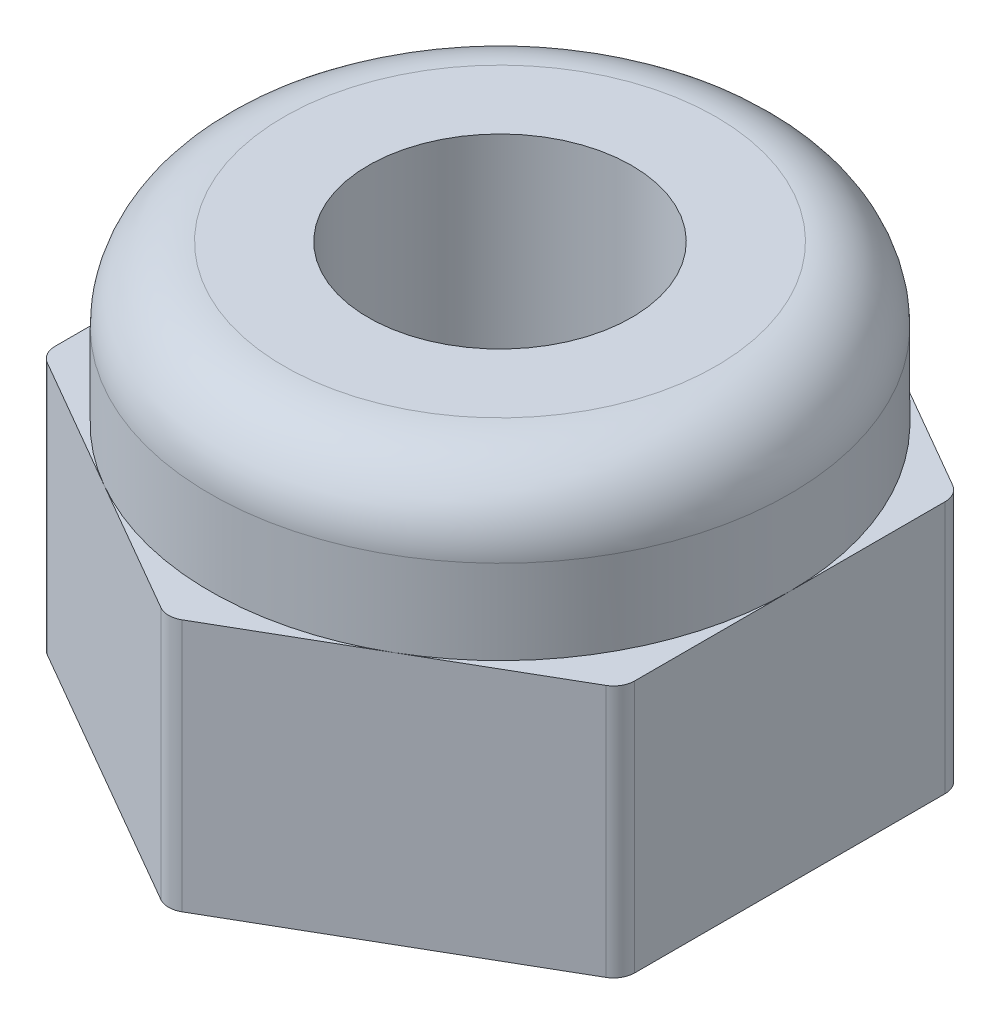
ISO-10303-21;
HEADER;
FILE_DESCRIPTION(('STEP AP214'),'2;1');
FILE_NAME('part.step','',(''),(''),'','','');
FILE_SCHEMA(('AUTOMOTIVE_DESIGN { 1 0 10303 214 1 1 1 1 }'));
ENDSEC;
DATA;
#1=APPLICATION_CONTEXT('core data for automotive mechanical design processes');
#2=APPLICATION_PROTOCOL_DEFINITION('international standard','automotive_design',2000,#1);
#3=PRODUCT_CONTEXT('',#1,'mechanical');
#4=PRODUCT('Part','Part','',(#3));
#5=PRODUCT_RELATED_PRODUCT_CATEGORY('part','',(#4));
#6=PRODUCT_DEFINITION_FORMATION('','',#4);
#7=PRODUCT_DEFINITION_CONTEXT('part definition',#1,'design');
#8=PRODUCT_DEFINITION('design','',#6,#7);
#9=PRODUCT_DEFINITION_SHAPE('','',#8);
#10=(LENGTH_UNIT() NAMED_UNIT(*) SI_UNIT(.MILLI.,.METRE.));
#11=(NAMED_UNIT(*) PLANE_ANGLE_UNIT() SI_UNIT($,.RADIAN.));
#12=(NAMED_UNIT(*) SI_UNIT($,.STERADIAN.) SOLID_ANGLE_UNIT());
#13=UNCERTAINTY_MEASURE_WITH_UNIT(LENGTH_MEASURE(1.E-05),#10,'distance_accuracy_value','');
#14=(GEOMETRIC_REPRESENTATION_CONTEXT(3) GLOBAL_UNCERTAINTY_ASSIGNED_CONTEXT((#13)) GLOBAL_UNIT_ASSIGNED_CONTEXT((#10,
#11,#12)) REPRESENTATION_CONTEXT('',''));
#15=CARTESIAN_POINT('',(0.,0.,0.));
#16=DIRECTION('',(0.,0.,1.));
#17=DIRECTION('',(1.,0.,0.));
#18=AXIS2_PLACEMENT_3D('',#15,#16,#17);
#19=CARTESIAN_POINT('',(0.,2.4,0.));
#20=DIRECTION('',(0.,1.,0.));
#21=DIRECTION('',(0.,0.,1.));
#22=AXIS2_PLACEMENT_3D('',#19,#20,#21);
#23=PLANE('',#22);
#24=DIRECTION('',(0.866025403784439,0.,-0.5));
#25=VECTOR('',#24,1.);
#26=CARTESIAN_POINT('',(0.,2.4,3.17542648054294));
#27=LINE('',#26,#25);
#28=CARTESIAN_POINT('',(1.375,2.4,2.38156986040721));
#29=VERTEX_POINT('',#28);
#30=CARTESIAN_POINT('',(2.65,2.4,1.64544826719043));
#31=VERTEX_POINT('',#30);
#32=EDGE_CURVE('E165',#29,#31,#27,.T.);
#33=ORIENTED_EDGE('',*,*,#32,.T.);
#34=CARTESIAN_POINT('',(2.55,2.4,1.47224318643355));
#35=DIRECTION('',(0.,1.,0.));
#36=DIRECTION('',(0.,0.,1.));
#37=AXIS2_PLACEMENT_3D('',#34,#35,#36);
#38=CIRCLE('',#37,0.2);
#39=CARTESIAN_POINT('',(2.75,2.4,1.47224318643355));
#40=VERTEX_POINT('',#39);
#41=EDGE_CURVE('E288',#31,#40,#38,.T.);
#42=ORIENTED_EDGE('',*,*,#41,.T.);
#43=DIRECTION('',(0.,0.,-1.));
#44=VECTOR('',#43,1.);
#45=CARTESIAN_POINT('',(2.75,2.4,1.58771324027147));
#46=LINE('',#45,#44);
#47=CARTESIAN_POINT('',(2.75,2.4,0.));
#48=VERTEX_POINT('',#47);
#49=EDGE_CURVE('E180',#40,#48,#46,.T.);
#50=ORIENTED_EDGE('',*,*,#49,.T.);
#51=CARTESIAN_POINT('',(0.,2.4,0.));
#52=DIRECTION('',(0.,1.,0.));
#53=DIRECTION('',(0.,0.,1.));
#54=AXIS2_PLACEMENT_3D('',#51,#52,#53);
#55=CIRCLE('',#54,2.75);
#56=EDGE_CURVE('E178',#29,#48,#55,.T.);
#57=ORIENTED_EDGE('',*,*,#56,.F.);
#58=EDGE_LOOP('',(#33,#42,#50,#57));
#59=FACE_BOUND('',#58,.T.);
#60=ADVANCED_FACE('F41',(#59),#23,.T.);
#61=CARTESIAN_POINT('',(2.75,2.4,-1.47224318643355));
#62=VERTEX_POINT('',#61);
#63=EDGE_CURVE('E164',#48,#62,#46,.T.);
#64=ORIENTED_EDGE('',*,*,#63,.T.);
#65=CARTESIAN_POINT('',(2.55,2.4,-1.47224318643355));
#66=DIRECTION('',(0.,1.,0.));
#67=DIRECTION('',(0.,0.,1.));
#68=AXIS2_PLACEMENT_3D('',#65,#66,#67);
#69=CIRCLE('',#68,0.2);
#70=CARTESIAN_POINT('',(2.65,2.4,-1.64544826719043));
#71=VERTEX_POINT('',#70);
#72=EDGE_CURVE('E280',#62,#71,#69,.T.);
#73=ORIENTED_EDGE('',*,*,#72,.T.);
#74=DIRECTION('',(-0.866025403784439,0.,-0.5));
#75=VECTOR('',#74,1.);
#76=CARTESIAN_POINT('',(2.75,2.4,-1.58771324027147));
#77=LINE('',#76,#75);
#78=CARTESIAN_POINT('',(1.375,2.4,-2.38156986040721));
#79=VERTEX_POINT('',#78);
#80=EDGE_CURVE('E205',#71,#79,#77,.T.);
#81=ORIENTED_EDGE('',*,*,#80,.T.);
#82=EDGE_CURVE('E186',#48,#79,#55,.T.);
#83=ORIENTED_EDGE('',*,*,#82,.F.);
#84=EDGE_LOOP('',(#64,#73,#81,#83));
#85=FACE_BOUND('',#84,.T.);
#86=ADVANCED_FACE('F383',(#85),#23,.T.);
#87=CARTESIAN_POINT('',(0.0999999999999998,2.4,-3.11769145362398));
#88=VERTEX_POINT('',#87);
#89=EDGE_CURVE('E204',#79,#88,#77,.T.);
#90=ORIENTED_EDGE('',*,*,#89,.T.);
#91=CARTESIAN_POINT('',(0.,2.4,-2.94448637286709));
#92=DIRECTION('',(0.,1.,0.));
#93=DIRECTION('',(0.,0.,1.));
#94=AXIS2_PLACEMENT_3D('',#91,#92,#93);
#95=CIRCLE('',#94,0.2);
#96=CARTESIAN_POINT('',(-0.0999999999999997,2.4,-3.11769145362398));
#97=VERTEX_POINT('',#96);
#98=EDGE_CURVE('E11',#88,#97,#95,.T.);
#99=ORIENTED_EDGE('',*,*,#98,.T.);
#100=DIRECTION('',(-0.866025403784439,0.,0.5));
#101=VECTOR('',#100,1.);
#102=CARTESIAN_POINT('',(0.,2.4,-3.17542648054294));
#103=LINE('',#102,#101);
#104=CARTESIAN_POINT('',(-1.375,2.4,-2.38156986040721));
#105=VERTEX_POINT('',#104);
#106=EDGE_CURVE('E209',#97,#105,#103,.T.);
#107=ORIENTED_EDGE('',*,*,#106,.T.);
#108=EDGE_CURVE('E377',#79,#105,#55,.T.);
#109=ORIENTED_EDGE('',*,*,#108,.F.);
#110=EDGE_LOOP('',(#90,#99,#107,#109));
#111=FACE_BOUND('',#110,.T.);
#112=ADVANCED_FACE('F381',(#111),#23,.T.);
#113=CARTESIAN_POINT('',(-2.65,2.4,-1.64544826719043));
#114=VERTEX_POINT('',#113);
#115=EDGE_CURVE('E208',#105,#114,#103,.T.);
#116=ORIENTED_EDGE('',*,*,#115,.T.);
#117=CARTESIAN_POINT('',(-2.55,2.4,-1.47224318643355));
#118=DIRECTION('',(0.,1.,0.));
#119=DIRECTION('',(0.,0.,1.));
#120=AXIS2_PLACEMENT_3D('',#117,#118,#119);
#121=CIRCLE('',#120,0.2);
#122=CARTESIAN_POINT('',(-2.75,2.4,-1.47224318643355));
#123=VERTEX_POINT('',#122);
#124=EDGE_CURVE('E51',#114,#123,#121,.T.);
#125=ORIENTED_EDGE('',*,*,#124,.T.);
#126=DIRECTION('',(0.,0.,1.));
#127=VECTOR('',#126,1.);
#128=CARTESIAN_POINT('',(-2.75,2.4,-1.58771324027147));
#129=LINE('',#128,#127);
#130=CARTESIAN_POINT('',(-2.75,2.4,0.));
#131=VERTEX_POINT('',#130);
#132=EDGE_CURVE('E213',#123,#131,#129,.T.);
#133=ORIENTED_EDGE('',*,*,#132,.T.);
#134=EDGE_CURVE('E196',#105,#131,#55,.T.);
#135=ORIENTED_EDGE('',*,*,#134,.F.);
#136=EDGE_LOOP('',(#116,#125,#133,#135));
#137=FACE_BOUND('',#136,.T.);
#138=ADVANCED_FACE('F320',(#137),#23,.T.);
#139=CARTESIAN_POINT('',(-2.75,2.4,1.47224318643355));
#140=VERTEX_POINT('',#139);
#141=EDGE_CURVE('E212',#131,#140,#129,.T.);
#142=ORIENTED_EDGE('',*,*,#141,.T.);
#143=CARTESIAN_POINT('',(-2.55,2.4,1.47224318643355));
#144=DIRECTION('',(0.,1.,0.));
#145=DIRECTION('',(0.,0.,1.));
#146=AXIS2_PLACEMENT_3D('',#143,#144,#145);
#147=CIRCLE('',#146,0.2);
#148=CARTESIAN_POINT('',(-2.65,2.4,1.64544826719043));
#149=VERTEX_POINT('',#148);
#150=EDGE_CURVE('E307',#140,#149,#147,.T.);
#151=ORIENTED_EDGE('',*,*,#150,.T.);
#152=DIRECTION('',(0.866025403784438,0.,0.5));
#153=VECTOR('',#152,1.);
#154=CARTESIAN_POINT('',(-2.75,2.4,1.58771324027147));
#155=LINE('',#154,#153);
#156=CARTESIAN_POINT('',(-1.375,2.4,2.38156986040721));
#157=VERTEX_POINT('',#156);
#158=EDGE_CURVE('E217',#149,#157,#155,.T.);
#159=ORIENTED_EDGE('',*,*,#158,.T.);
#160=EDGE_CURVE('E192',#131,#157,#55,.T.);
#161=ORIENTED_EDGE('',*,*,#160,.F.);
#162=EDGE_LOOP('',(#142,#151,#159,#161));
#163=FACE_BOUND('',#162,.T.);
#164=ADVANCED_FACE('F369',(#163),#23,.T.);
#165=CARTESIAN_POINT('',(0.,2.4,3.17542648054294));
#166=DIRECTION('',(-0.5,0.,-0.866025403784439));
#167=DIRECTION('',(-0.866025403784439,0.,0.5));
#168=AXIS2_PLACEMENT_3D('',#165,#166,#167);
#169=PLANE('',#168);
#170=DIRECTION('',(0.866025403784439,0.,-0.5));
#171=VECTOR('',#170,1.);
#172=CARTESIAN_POINT('',(0.,0.,3.17542648054294));
#173=LINE('',#172,#171);
#174=CARTESIAN_POINT('',(0.0999999999999998,0.,3.11769145362398));
#175=VERTEX_POINT('',#174);
#176=CARTESIAN_POINT('',(2.65,0.,1.64544826719043));
#177=VERTEX_POINT('',#176);
#178=EDGE_CURVE('E185',#175,#177,#173,.T.);
#179=ORIENTED_EDGE('',*,*,#178,.T.);
#180=DIRECTION('',(0.,-1.,0.));
#181=VECTOR('',#180,1.);
#182=CARTESIAN_POINT('',(2.65,2.4,1.64544826719043));
#183=LINE('',#182,#181);
#184=EDGE_CURVE('E172',#177,#31,#183,.F.);
#185=ORIENTED_EDGE('',*,*,#184,.T.);
#186=ORIENTED_EDGE('',*,*,#32,.F.);
#187=CARTESIAN_POINT('',(0.0999999999999998,2.4,3.11769145362398));
#188=VERTEX_POINT('',#187);
#189=EDGE_CURVE('E151',#188,#29,#27,.T.);
#190=ORIENTED_EDGE('',*,*,#189,.F.);
#191=DIRECTION('',(0.,-1.,0.));
#192=VECTOR('',#191,1.);
#193=CARTESIAN_POINT('',(0.0999999999999998,2.4,3.11769145362398));
#194=LINE('',#193,#192);
#195=EDGE_CURVE('E283',#188,#175,#194,.T.);
#196=ORIENTED_EDGE('',*,*,#195,.T.);
#197=EDGE_LOOP('',(#179,#185,#186,#190,#196));
#198=FACE_BOUND('',#197,.T.);
#199=ADVANCED_FACE('F170',(#198),#169,.F.);
#200=CARTESIAN_POINT('',(2.75,2.4,1.58771324027147));
#201=DIRECTION('',(-1.,0.,0.));
#202=DIRECTION('',(0.,0.,1.));
#203=AXIS2_PLACEMENT_3D('',#200,#201,#202);
#204=PLANE('',#203);
#205=DIRECTION('',(0.,0.,-1.));
#206=VECTOR('',#205,1.);
#207=CARTESIAN_POINT('',(2.75,0.,1.58771324027147));
#208=LINE('',#207,#206);
#209=CARTESIAN_POINT('',(2.75,0.,1.47224318643355));
#210=VERTEX_POINT('',#209);
#211=CARTESIAN_POINT('',(2.75,0.,-1.47224318643355));
#212=VERTEX_POINT('',#211);
#213=EDGE_CURVE('E223',#210,#212,#208,.T.);
#214=ORIENTED_EDGE('',*,*,#213,.T.);
#215=DIRECTION('',(0.,-1.,0.));
#216=VECTOR('',#215,1.);
#217=CARTESIAN_POINT('',(2.75,2.4,-1.47224318643355));
#218=LINE('',#217,#216);
#219=EDGE_CURVE('E277',#212,#62,#218,.F.);
#220=ORIENTED_EDGE('',*,*,#219,.T.);
#221=ORIENTED_EDGE('',*,*,#63,.F.);
#222=ORIENTED_EDGE('',*,*,#49,.F.);
#223=DIRECTION('',(0.,-1.,0.));
#224=VECTOR('',#223,1.);
#225=CARTESIAN_POINT('',(2.75,2.4,1.47224318643355));
#226=LINE('',#225,#224);
#227=EDGE_CURVE('E273',#40,#210,#226,.T.);
#228=ORIENTED_EDGE('',*,*,#227,.T.);
#229=EDGE_LOOP('',(#214,#220,#221,#222,#228));
#230=FACE_BOUND('',#229,.T.);
#231=ADVANCED_FACE('F349',(#230),#204,.F.);
#232=CARTESIAN_POINT('',(2.75,2.4,-1.58771324027147));
#233=DIRECTION('',(-0.5,0.,0.866025403784439));
#234=DIRECTION('',(0.866025403784439,0.,0.5));
#235=AXIS2_PLACEMENT_3D('',#232,#233,#234);
#236=PLANE('',#235);
#237=ORIENTED_EDGE('',*,*,#80,.F.);
#238=DIRECTION('',(0.,-1.,0.));
#239=VECTOR('',#238,1.);
#240=CARTESIAN_POINT('',(2.65,2.4,-1.64544826719043));
#241=LINE('',#240,#239);
#242=CARTESIAN_POINT('',(2.65,0.,-1.64544826719043));
#243=VERTEX_POINT('',#242);
#244=EDGE_CURVE('E251',#71,#243,#241,.T.);
#245=ORIENTED_EDGE('',*,*,#244,.T.);
#246=DIRECTION('',(-0.866025403784439,0.,-0.5));
#247=VECTOR('',#246,1.);
#248=CARTESIAN_POINT('',(2.75,0.,-1.58771324027147));
#249=LINE('',#248,#247);
#250=CARTESIAN_POINT('',(0.0999999999999998,0.,-3.11769145362398));
#251=VERTEX_POINT('',#250);
#252=EDGE_CURVE('E227',#243,#251,#249,.T.);
#253=ORIENTED_EDGE('',*,*,#252,.T.);
#254=DIRECTION('',(0.,-1.,0.));
#255=VECTOR('',#254,1.);
#256=CARTESIAN_POINT('',(0.100000000000001,2.4,-3.11769145362398));
#257=LINE('',#256,#255);
#258=EDGE_CURVE('E248',#251,#88,#257,.F.);
#259=ORIENTED_EDGE('',*,*,#258,.T.);
#260=ORIENTED_EDGE('',*,*,#89,.F.);
#261=EDGE_LOOP('',(#237,#245,#253,#259,#260));
#262=FACE_BOUND('',#261,.T.);
#263=ADVANCED_FACE('F340',(#262),#236,.F.);
#264=CARTESIAN_POINT('',(0.,2.4,-3.17542648054294));
#265=DIRECTION('',(0.5,0.,0.866025403784439));
#266=DIRECTION('',(0.866025403784439,0.,-0.5));
#267=AXIS2_PLACEMENT_3D('',#264,#265,#266);
#268=PLANE('',#267);
#269=DIRECTION('',(-0.866025403784439,0.,0.5));
#270=VECTOR('',#269,1.);
#271=CARTESIAN_POINT('',(0.,0.,-3.17542648054294));
#272=LINE('',#271,#270);
#273=CARTESIAN_POINT('',(-0.0999999999999997,0.,-3.11769145362398));
#274=VERTEX_POINT('',#273);
#275=CARTESIAN_POINT('',(-2.65,0.,-1.64544826719043));
#276=VERTEX_POINT('',#275);
#277=EDGE_CURVE('E231',#274,#276,#272,.T.);
#278=ORIENTED_EDGE('',*,*,#277,.T.);
#279=DIRECTION('',(0.,-1.,0.));
#280=VECTOR('',#279,1.);
#281=CARTESIAN_POINT('',(-2.65,2.4,-1.64544826719043));
#282=LINE('',#281,#280);
#283=EDGE_CURVE('E64',#276,#114,#282,.F.);
#284=ORIENTED_EDGE('',*,*,#283,.T.);
#285=ORIENTED_EDGE('',*,*,#115,.F.);
#286=ORIENTED_EDGE('',*,*,#106,.F.);
#287=DIRECTION('',(0.,-1.,0.));
#288=VECTOR('',#287,1.);
#289=CARTESIAN_POINT('',(-0.0999999999999997,2.4,-3.11769145362398));
#290=LINE('',#289,#288);
#291=EDGE_CURVE('E310',#97,#274,#290,.T.);
#292=ORIENTED_EDGE('',*,*,#291,.T.);
#293=EDGE_LOOP('',(#278,#284,#285,#286,#292));
#294=FACE_BOUND('',#293,.T.);
#295=ADVANCED_FACE('F334',(#294),#268,.F.);
#296=CARTESIAN_POINT('',(-2.75,2.4,-1.58771324027147));
#297=DIRECTION('',(1.,0.,0.));
#298=DIRECTION('',(0.,0.,-1.));
#299=AXIS2_PLACEMENT_3D('',#296,#297,#298);
#300=PLANE('',#299);
#301=DIRECTION('',(0.,0.,1.));
#302=VECTOR('',#301,1.);
#303=CARTESIAN_POINT('',(-2.75,0.,-1.58771324027147));
#304=LINE('',#303,#302);
#305=CARTESIAN_POINT('',(-2.75,0.,-1.47224318643355));
#306=VERTEX_POINT('',#305);
#307=CARTESIAN_POINT('',(-2.75,0.,1.47224318643355));
#308=VERTEX_POINT('',#307);
#309=EDGE_CURVE('E234',#306,#308,#304,.T.);
#310=ORIENTED_EDGE('',*,*,#309,.T.);
#311=DIRECTION('',(0.,-1.,0.));
#312=VECTOR('',#311,1.);
#313=CARTESIAN_POINT('',(-2.75,2.4,1.47224318643355));
#314=LINE('',#313,#312);
#315=EDGE_CURVE('E304',#308,#140,#314,.F.);
#316=ORIENTED_EDGE('',*,*,#315,.T.);
#317=ORIENTED_EDGE('',*,*,#141,.F.);
#318=ORIENTED_EDGE('',*,*,#132,.F.);
#319=DIRECTION('',(0.,-1.,0.));
#320=VECTOR('',#319,1.);
#321=CARTESIAN_POINT('',(-2.75,2.4,-1.47224318643355));
#322=LINE('',#321,#320);
#323=EDGE_CURVE('E300',#123,#306,#322,.T.);
#324=ORIENTED_EDGE('',*,*,#323,.T.);
#325=EDGE_LOOP('',(#310,#316,#317,#318,#324));
#326=FACE_BOUND('',#325,.T.);
#327=ADVANCED_FACE('F326',(#326),#300,.F.);
#328=CARTESIAN_POINT('',(-2.75,2.4,1.58771324027147));
#329=DIRECTION('',(0.5,0.,-0.866025403784438));
#330=DIRECTION('',(-0.866025403784439,0.,-0.5));
#331=AXIS2_PLACEMENT_3D('',#328,#329,#330);
#332=PLANE('',#331);
#333=DIRECTION('',(0.866025403784438,0.,0.5));
#334=VECTOR('',#333,1.);
#335=CARTESIAN_POINT('',(-2.75,0.,1.58771324027147));
#336=LINE('',#335,#334);
#337=CARTESIAN_POINT('',(-2.65,0.,1.64544826719043));
#338=VERTEX_POINT('',#337);
#339=CARTESIAN_POINT('',(-0.100000000000001,0.,3.11769145362398));
#340=VERTEX_POINT('',#339);
#341=EDGE_CURVE('E176',#338,#340,#336,.T.);
#342=ORIENTED_EDGE('',*,*,#341,.T.);
#343=DIRECTION('',(0.,-1.,0.));
#344=VECTOR('',#343,1.);
#345=CARTESIAN_POINT('',(-0.0999999999999998,2.4,3.11769145362398));
#346=LINE('',#345,#344);
#347=CARTESIAN_POINT('',(-0.100000000000001,2.4,3.11769145362398));
#348=VERTEX_POINT('',#347);
#349=EDGE_CURVE('E295',#340,#348,#346,.F.);
#350=ORIENTED_EDGE('',*,*,#349,.T.);
#351=EDGE_CURVE('E216',#157,#348,#155,.T.);
#352=ORIENTED_EDGE('',*,*,#351,.F.);
#353=ORIENTED_EDGE('',*,*,#158,.F.);
#354=DIRECTION('',(0.,-1.,0.));
#355=VECTOR('',#354,1.);
#356=CARTESIAN_POINT('',(-2.65,2.4,1.64544826719043));
#357=LINE('',#356,#355);
#358=EDGE_CURVE('E291',#149,#338,#357,.T.);
#359=ORIENTED_EDGE('',*,*,#358,.T.);
#360=EDGE_LOOP('',(#342,#350,#352,#353,#359));
#361=FACE_BOUND('',#360,.T.);
#362=ADVANCED_FACE('F361',(#361),#332,.F.);
#363=ORIENTED_EDGE('',*,*,#351,.T.);
#364=CARTESIAN_POINT('',(0.,2.4,2.94448637286709));
#365=DIRECTION('',(0.,1.,0.));
#366=DIRECTION('',(0.,0.,1.));
#367=AXIS2_PLACEMENT_3D('',#364,#365,#366);
#368=CIRCLE('',#367,0.2);
#369=EDGE_CURVE('E159',#348,#188,#368,.T.);
#370=ORIENTED_EDGE('',*,*,#369,.T.);
#371=ORIENTED_EDGE('',*,*,#189,.T.);
#372=EDGE_CURVE('E156',#157,#29,#55,.T.);
#373=ORIENTED_EDGE('',*,*,#372,.F.);
#374=EDGE_LOOP('',(#363,#370,#371,#373));
#375=FACE_BOUND('',#374,.T.);
#376=ADVANCED_FACE('F154',(#375),#23,.T.);
#377=CARTESIAN_POINT('',(0.,0.,0.));
#378=DIRECTION('',(0.,1.,0.));
#379=DIRECTION('',(0.,0.,1.));
#380=AXIS2_PLACEMENT_3D('',#377,#378,#379);
#381=PLANE('',#380);
#382=CARTESIAN_POINT('',(0.,0.,0.));
#383=DIRECTION('',(0.,-1.,0.));
#384=DIRECTION('',(0.,0.,-1.));
#385=AXIS2_PLACEMENT_3D('',#382,#383,#384);
#386=CIRCLE('',#385,1.525);
#387=CARTESIAN_POINT('',(0.,0.,-1.525));
#388=VERTEX_POINT('',#387);
#389=EDGE_CURVE('E590',#388,#388,#386,.T.);
#390=ORIENTED_EDGE('',*,*,#389,.F.);
#391=EDGE_LOOP('',(#390));
#392=FACE_BOUND('',#391,.T.);
#393=ORIENTED_EDGE('',*,*,#252,.F.);
#394=CARTESIAN_POINT('',(2.55,0.,-1.47224318643355));
#395=DIRECTION('',(0.,1.,0.));
#396=DIRECTION('',(0.,0.,1.));
#397=AXIS2_PLACEMENT_3D('',#394,#395,#396);
#398=CIRCLE('',#397,0.2);
#399=EDGE_CURVE('E270',#243,#212,#398,.F.);
#400=ORIENTED_EDGE('',*,*,#399,.T.);
#401=ORIENTED_EDGE('',*,*,#213,.F.);
#402=CARTESIAN_POINT('',(2.55,0.,1.47224318643355));
#403=DIRECTION('',(0.,1.,0.));
#404=DIRECTION('',(0.,0.,1.));
#405=AXIS2_PLACEMENT_3D('',#402,#403,#404);
#406=CIRCLE('',#405,0.2);
#407=EDGE_CURVE('E267',#210,#177,#406,.F.);
#408=ORIENTED_EDGE('',*,*,#407,.T.);
#409=ORIENTED_EDGE('',*,*,#178,.F.);
#410=CARTESIAN_POINT('',(0.,0.,2.94448637286709));
#411=DIRECTION('',(0.,1.,0.));
#412=DIRECTION('',(0.,0.,1.));
#413=AXIS2_PLACEMENT_3D('',#410,#411,#412);
#414=CIRCLE('',#413,0.2);
#415=EDGE_CURVE('E264',#175,#340,#414,.F.);
#416=ORIENTED_EDGE('',*,*,#415,.T.);
#417=ORIENTED_EDGE('',*,*,#341,.F.);
#418=CARTESIAN_POINT('',(-2.55,0.,1.47224318643355));
#419=DIRECTION('',(0.,1.,0.));
#420=DIRECTION('',(0.,0.,1.));
#421=AXIS2_PLACEMENT_3D('',#418,#419,#420);
#422=CIRCLE('',#421,0.2);
#423=EDGE_CURVE('E261',#338,#308,#422,.F.);
#424=ORIENTED_EDGE('',*,*,#423,.T.);
#425=ORIENTED_EDGE('',*,*,#309,.F.);
#426=CARTESIAN_POINT('',(-2.55,0.,-1.47224318643355));
#427=DIRECTION('',(0.,1.,0.));
#428=DIRECTION('',(0.,0.,1.));
#429=AXIS2_PLACEMENT_3D('',#426,#427,#428);
#430=CIRCLE('',#429,0.2);
#431=EDGE_CURVE('E258',#306,#276,#430,.F.);
#432=ORIENTED_EDGE('',*,*,#431,.T.);
#433=ORIENTED_EDGE('',*,*,#277,.F.);
#434=CARTESIAN_POINT('',(0.,0.,-2.94448637286709));
#435=DIRECTION('',(0.,1.,0.));
#436=DIRECTION('',(0.,0.,1.));
#437=AXIS2_PLACEMENT_3D('',#434,#435,#436);
#438=CIRCLE('',#437,0.2);
#439=EDGE_CURVE('E255',#274,#251,#438,.F.);
#440=ORIENTED_EDGE('',*,*,#439,.T.);
#441=EDGE_LOOP('',(#393,#400,#401,#408,#409,#416,#417,#424,#425,#432,#433,#440));
#442=FACE_BOUND('',#441,.T.);
#443=ADVANCED_FACE('F333',(#392,#442),#381,.F.);
#444=CARTESIAN_POINT('',(0.,3.9,0.));
#445=DIRECTION('',(0.,-1.,0.));
#446=DIRECTION('',(0.,0.,-1.));
#447=AXIS2_PLACEMENT_3D('',#444,#445,#446);
#448=CYLINDRICAL_SURFACE('',#447,2.75);
#449=CARTESIAN_POINT('',(0.,3.2,0.));
#450=DIRECTION('',(0.,-1.,0.));
#451=DIRECTION('',(0.,0.,-1.));
#452=AXIS2_PLACEMENT_3D('',#449,#450,#451);
#453=CIRCLE('',#452,2.75);
#454=CARTESIAN_POINT('',(0.,3.2,-2.75));
#455=VERTEX_POINT('',#454);
#456=EDGE_CURVE('E220',#455,#455,#453,.T.);
#457=ORIENTED_EDGE('',*,*,#456,.T.);
#458=EDGE_LOOP('',(#457));
#459=FACE_BOUND('',#458,.T.);
#460=ORIENTED_EDGE('',*,*,#372,.T.);
#461=ORIENTED_EDGE('',*,*,#56,.T.);
#462=ORIENTED_EDGE('',*,*,#82,.T.);
#463=ORIENTED_EDGE('',*,*,#108,.T.);
#464=ORIENTED_EDGE('',*,*,#134,.T.);
#465=ORIENTED_EDGE('',*,*,#160,.T.);
#466=EDGE_LOOP('',(#460,#461,#462,#463,#464,#465));
#467=FACE_BOUND('',#466,.T.);
#468=ADVANCED_FACE('F189',(#459,#467),#448,.T.);
#469=CARTESIAN_POINT('',(0.,3.9,0.));
#470=DIRECTION('',(0.,-1.,0.));
#471=DIRECTION('',(0.,0.,-1.));
#472=AXIS2_PLACEMENT_3D('',#469,#470,#471);
#473=PLANE('',#472);
#474=CARTESIAN_POINT('',(0.,3.9,0.));
#475=DIRECTION('',(0.,-1.,0.));
#476=DIRECTION('',(0.,0.,-1.));
#477=AXIS2_PLACEMENT_3D('',#474,#475,#476);
#478=CIRCLE('',#477,1.25);
#479=CARTESIAN_POINT('',(0.,3.9,-1.25));
#480=VERTEX_POINT('',#479);
#481=EDGE_CURVE('E45',#480,#480,#478,.T.);
#482=ORIENTED_EDGE('',*,*,#481,.T.);
#483=EDGE_LOOP('',(#482));
#484=FACE_BOUND('',#483,.T.);
#485=CARTESIAN_POINT('',(0.,3.9,0.));
#486=DIRECTION('',(0.,-1.,0.));
#487=DIRECTION('',(0.,0.,-1.));
#488=AXIS2_PLACEMENT_3D('',#485,#486,#487);
#489=CIRCLE('',#488,2.05);
#490=CARTESIAN_POINT('',(0.,3.9,-2.05));
#491=VERTEX_POINT('',#490);
#492=EDGE_CURVE('E244',#491,#491,#489,.F.);
#493=ORIENTED_EDGE('',*,*,#492,.T.);
#494=EDGE_LOOP('',(#493));
#495=FACE_BOUND('',#494,.T.);
#496=ADVANCED_FACE('F416',(#484,#495),#473,.F.);
#497=CARTESIAN_POINT('',(0.,3.2,0.));
#498=DIRECTION('',(0.,-1.,0.));
#499=DIRECTION('',(0.,0.,-1.));
#500=AXIS2_PLACEMENT_3D('',#497,#498,#499);
#501=TOROIDAL_SURFACE('',#500,2.05,0.7);
#502=ORIENTED_EDGE('',*,*,#492,.F.);
#503=EDGE_LOOP('',(#502));
#504=FACE_BOUND('',#503,.T.);
#505=ORIENTED_EDGE('',*,*,#456,.F.);
#506=EDGE_LOOP('',(#505));
#507=FACE_BOUND('',#506,.T.);
#508=ADVANCED_FACE('F413',(#504,#507),#501,.T.);
#509=CARTESIAN_POINT('',(2.55,2.4,-1.47224318643355));
#510=DIRECTION('',(0.,-1.,0.));
#511=DIRECTION('',(0.,0.,-1.));
#512=AXIS2_PLACEMENT_3D('',#509,#510,#511);
#513=CYLINDRICAL_SURFACE('',#512,0.2);
#514=ORIENTED_EDGE('',*,*,#72,.F.);
#515=ORIENTED_EDGE('',*,*,#219,.F.);
#516=ORIENTED_EDGE('',*,*,#399,.F.);
#517=ORIENTED_EDGE('',*,*,#244,.F.);
#518=EDGE_LOOP('',(#514,#515,#516,#517));
#519=FACE_BOUND('',#518,.T.);
#520=ADVANCED_FACE('F345',(#519),#513,.T.);
#521=CARTESIAN_POINT('',(2.55,2.4,1.47224318643355));
#522=DIRECTION('',(0.,-1.,0.));
#523=DIRECTION('',(0.,0.,-1.));
#524=AXIS2_PLACEMENT_3D('',#521,#522,#523);
#525=CYLINDRICAL_SURFACE('',#524,0.2);
#526=ORIENTED_EDGE('',*,*,#41,.F.);
#527=ORIENTED_EDGE('',*,*,#184,.F.);
#528=ORIENTED_EDGE('',*,*,#407,.F.);
#529=ORIENTED_EDGE('',*,*,#227,.F.);
#530=EDGE_LOOP('',(#526,#527,#528,#529));
#531=FACE_BOUND('',#530,.T.);
#532=ADVANCED_FACE('F354',(#531),#525,.T.);
#533=CARTESIAN_POINT('',(0.,2.4,2.94448637286709));
#534=DIRECTION('',(0.,-1.,0.));
#535=DIRECTION('',(0.,0.,-1.));
#536=AXIS2_PLACEMENT_3D('',#533,#534,#535);
#537=CYLINDRICAL_SURFACE('',#536,0.2);
#538=ORIENTED_EDGE('',*,*,#369,.F.);
#539=ORIENTED_EDGE('',*,*,#349,.F.);
#540=ORIENTED_EDGE('',*,*,#415,.F.);
#541=ORIENTED_EDGE('',*,*,#195,.F.);
#542=EDGE_LOOP('',(#538,#539,#540,#541));
#543=FACE_BOUND('',#542,.T.);
#544=ADVANCED_FACE('F357',(#543),#537,.T.);
#545=CARTESIAN_POINT('',(-2.55,2.4,1.47224318643355));
#546=DIRECTION('',(0.,-1.,0.));
#547=DIRECTION('',(0.,0.,-1.));
#548=AXIS2_PLACEMENT_3D('',#545,#546,#547);
#549=CYLINDRICAL_SURFACE('',#548,0.2);
#550=ORIENTED_EDGE('',*,*,#150,.F.);
#551=ORIENTED_EDGE('',*,*,#315,.F.);
#552=ORIENTED_EDGE('',*,*,#423,.F.);
#553=ORIENTED_EDGE('',*,*,#358,.F.);
#554=EDGE_LOOP('',(#550,#551,#552,#553));
#555=FACE_BOUND('',#554,.T.);
#556=ADVANCED_FACE('F366',(#555),#549,.T.);
#557=CARTESIAN_POINT('',(-2.55,2.4,-1.47224318643355));
#558=DIRECTION('',(0.,-1.,0.));
#559=DIRECTION('',(0.,0.,-1.));
#560=AXIS2_PLACEMENT_3D('',#557,#558,#559);
#561=CYLINDRICAL_SURFACE('',#560,0.2);
#562=ORIENTED_EDGE('',*,*,#124,.F.);
#563=ORIENTED_EDGE('',*,*,#283,.F.);
#564=ORIENTED_EDGE('',*,*,#431,.F.);
#565=ORIENTED_EDGE('',*,*,#323,.F.);
#566=EDGE_LOOP('',(#562,#563,#564,#565));
#567=FACE_BOUND('',#566,.T.);
#568=ADVANCED_FACE('F329',(#567),#561,.T.);
#569=CARTESIAN_POINT('',(0.,2.4,-2.94448637286709));
#570=DIRECTION('',(0.,-1.,0.));
#571=DIRECTION('',(0.,0.,-1.));
#572=AXIS2_PLACEMENT_3D('',#569,#570,#571);
#573=CYLINDRICAL_SURFACE('',#572,0.2);
#574=ORIENTED_EDGE('',*,*,#98,.F.);
#575=ORIENTED_EDGE('',*,*,#258,.F.);
#576=ORIENTED_EDGE('',*,*,#439,.F.);
#577=ORIENTED_EDGE('',*,*,#291,.F.);
#578=EDGE_LOOP('',(#574,#575,#576,#577));
#579=FACE_BOUND('',#578,.T.);
#580=ADVANCED_FACE('F43',(#579),#573,.T.);
#581=CARTESIAN_POINT('',(0.,0.,0.));
#582=DIRECTION('',(0.,-1.,0.));
#583=DIRECTION('',(0.,0.,-1.));
#584=AXIS2_PLACEMENT_3D('',#581,#582,#583);
#585=CYLINDRICAL_SURFACE('',#584,1.25);
#586=CARTESIAN_POINT('',(0.,0.274999999999999,0.));
#587=DIRECTION('',(0.,-1.,0.));
#588=DIRECTION('',(0.,0.,-1.));
#589=AXIS2_PLACEMENT_3D('',#586,#587,#588);
#590=CIRCLE('',#589,1.25);
#591=CARTESIAN_POINT('',(0.,0.274999999999999,-1.25));
#592=VERTEX_POINT('',#591);
#593=EDGE_CURVE('E198',#592,#592,#590,.T.);
#594=ORIENTED_EDGE('',*,*,#593,.T.);
#595=EDGE_LOOP('',(#594));
#596=FACE_BOUND('',#595,.T.);
#597=ORIENTED_EDGE('',*,*,#481,.F.);
#598=EDGE_LOOP('',(#597));
#599=FACE_BOUND('',#598,.T.);
#600=ADVANCED_FACE('F429',(#596,#599),#585,.F.);
#601=CARTESIAN_POINT('',(0.,0.,0.));
#602=DIRECTION('',(0.,-1.,0.));
#603=DIRECTION('',(0.,0.,-1.));
#604=AXIS2_PLACEMENT_3D('',#601,#602,#603);
#605=CONICAL_SURFACE('',#604,1.525,0.785398163397452);
#606=ORIENTED_EDGE('',*,*,#593,.F.);
#607=EDGE_LOOP('',(#606));
#608=FACE_BOUND('',#607,.T.);
#609=ORIENTED_EDGE('',*,*,#389,.T.);
#610=EDGE_LOOP('',(#609));
#611=FACE_BOUND('',#610,.T.);
#612=ADVANCED_FACE('F433',(#608,#611),#605,.F.);
#613=CLOSED_SHELL('',(#60,#86,#112,#138,#164,#199,#231,#263,#295,#327,#362,#376,#443,#468,#496,
#508,#520,#532,#544,#556,#568,#580,#600,#612));
#614=MANIFOLD_SOLID_BREP('B2',#613);
#615=ADVANCED_BREP_SHAPE_REPRESENTATION('',(#18,#614),#14);
#616=SHAPE_DEFINITION_REPRESENTATION(#9,#615);
ENDSEC;
END-ISO-10303-21;
